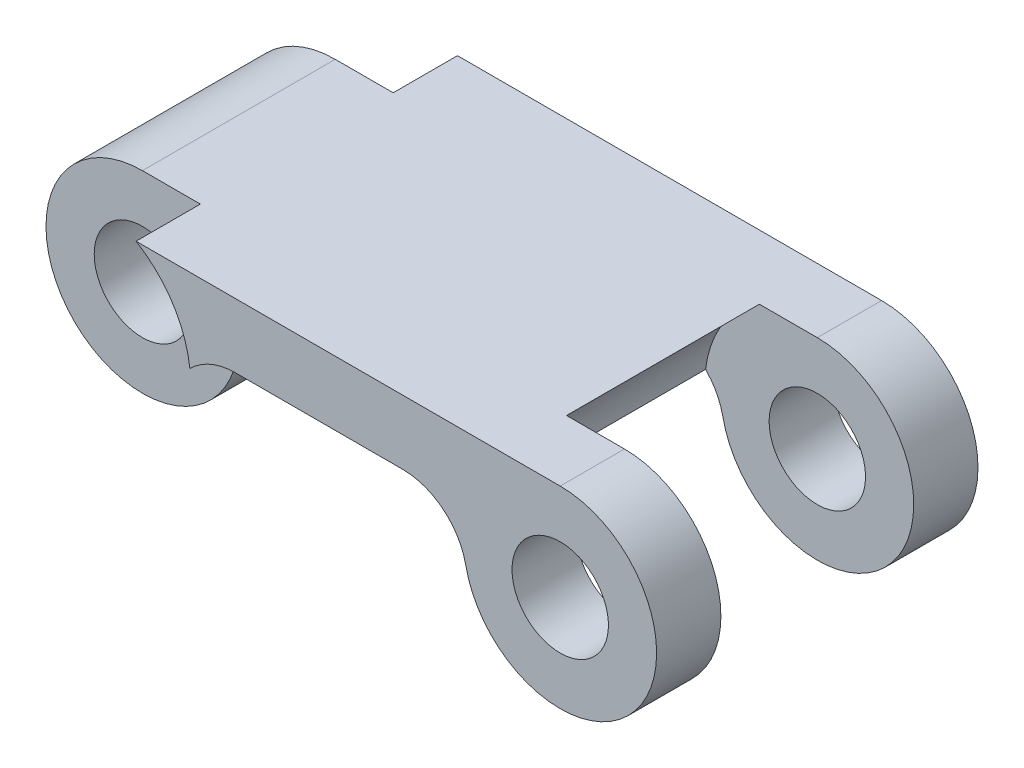
ISO-10303-21;
HEADER;
FILE_DESCRIPTION(('STEP AP214'),'2;1');
FILE_NAME('part.step','',(''),(''),'','','');
FILE_SCHEMA(('AUTOMOTIVE_DESIGN { 1 0 10303 214 1 1 1 1 }'));
ENDSEC;
DATA;
#1=APPLICATION_CONTEXT('core data for automotive mechanical design processes');
#2=APPLICATION_PROTOCOL_DEFINITION('international standard','automotive_design',2000,#1);
#3=PRODUCT_CONTEXT('',#1,'mechanical');
#4=PRODUCT('Part','Part','',(#3));
#5=PRODUCT_RELATED_PRODUCT_CATEGORY('part','',(#4));
#6=PRODUCT_DEFINITION_FORMATION('','',#4);
#7=PRODUCT_DEFINITION_CONTEXT('part definition',#1,'design');
#8=PRODUCT_DEFINITION('design','',#6,#7);
#9=PRODUCT_DEFINITION_SHAPE('','',#8);
#10=(LENGTH_UNIT() NAMED_UNIT(*) SI_UNIT(.MILLI.,.METRE.));
#11=(NAMED_UNIT(*) PLANE_ANGLE_UNIT() SI_UNIT($,.RADIAN.));
#12=(NAMED_UNIT(*) SI_UNIT($,.STERADIAN.) SOLID_ANGLE_UNIT());
#13=UNCERTAINTY_MEASURE_WITH_UNIT(LENGTH_MEASURE(1.E-05),#10,'distance_accuracy_value','');
#14=(GEOMETRIC_REPRESENTATION_CONTEXT(3) GLOBAL_UNCERTAINTY_ASSIGNED_CONTEXT((#13)) GLOBAL_UNIT_ASSIGNED_CONTEXT((#10,
#11,#12)) REPRESENTATION_CONTEXT('',''));
#15=CARTESIAN_POINT('',(0.,0.,0.));
#16=DIRECTION('',(0.,0.,1.));
#17=DIRECTION('',(1.,0.,0.));
#18=AXIS2_PLACEMENT_3D('',#15,#16,#17);
#19=CARTESIAN_POINT('',(-21.9965399719067,9.31366870482719,10.));
#20=DIRECTION('',(0.,1.,0.));
#21=DIRECTION('',(0.,0.,1.));
#22=AXIS2_PLACEMENT_3D('',#19,#20,#21);
#23=PLANE('',#22);
#24=DIRECTION('',(1.,0.,0.));
#25=VECTOR('',#24,1.);
#26=CARTESIAN_POINT('',(-21.9965399719067,9.31366870482719,0.));
#27=LINE('',#26,#25);
#28=CARTESIAN_POINT('',(-19.9259876110865,9.31366870482719,0.));
#29=VERTEX_POINT('',#28);
#30=CARTESIAN_POINT('',(-14.7239465822193,9.31366870482719,0.));
#31=VERTEX_POINT('',#30);
#32=EDGE_CURVE('E237',#29,#31,#27,.T.);
#33=ORIENTED_EDGE('',*,*,#32,.T.);
#34=DIRECTION('',(0.,0.,1.));
#35=VECTOR('',#34,1.);
#36=CARTESIAN_POINT('',(-14.7239465822193,9.31366870482719,2.));
#37=LINE('',#36,#35);
#38=CARTESIAN_POINT('',(-14.7239465822193,9.31366870482719,10.));
#39=VERTEX_POINT('',#38);
#40=EDGE_CURVE('E183',#31,#39,#37,.T.);
#41=ORIENTED_EDGE('',*,*,#40,.T.);
#42=DIRECTION('',(1.,0.,0.));
#43=VECTOR('',#42,1.);
#44=CARTESIAN_POINT('',(-21.9965399719067,9.31366870482719,10.));
#45=LINE('',#44,#43);
#46=CARTESIAN_POINT('',(-19.9259876110865,9.31366870482719,10.));
#47=VERTEX_POINT('',#46);
#48=EDGE_CURVE('E240',#47,#39,#45,.T.);
#49=ORIENTED_EDGE('',*,*,#48,.F.);
#50=DIRECTION('',(0.,0.,1.));
#51=VECTOR('',#50,1.);
#52=CARTESIAN_POINT('',(-19.9259876110865,9.31366870482719,2.));
#53=LINE('',#52,#51);
#54=EDGE_CURVE('E150',#47,#29,#53,.F.);
#55=ORIENTED_EDGE('',*,*,#54,.T.);
#56=EDGE_LOOP('',(#33,#41,#49,#55));
#57=FACE_BOUND('',#56,.T.);
#58=ADVANCED_FACE('F33',(#57),#23,.F.);
#59=CARTESIAN_POINT('',(-9.82496709665291,8.3136687048272,10.));
#60=DIRECTION('',(0.,0.,-1.));
#61=DIRECTION('',(-1.,0.,0.));
#62=AXIS2_PLACEMENT_3D('',#59,#60,#61);
#63=CYLINDRICAL_SURFACE('',#62,3.);
#64=CARTESIAN_POINT('',(-9.82496709665291,8.3136687048272,10.));
#65=DIRECTION('',(0.,0.,1.));
#66=DIRECTION('',(-1.,0.,0.));
#67=AXIS2_PLACEMENT_3D('',#64,#65,#66);
#68=CIRCLE('',#67,3.);
#69=CARTESIAN_POINT('',(-12.7643547879927,7.7136687048272,10.));
#70=VERTEX_POINT('',#69);
#71=CARTESIAN_POINT('',(-9.82496709665291,11.3136687048272,10.));
#72=VERTEX_POINT('',#71);
#73=EDGE_CURVE('E243',#70,#72,#68,.T.);
#74=ORIENTED_EDGE('',*,*,#73,.F.);
#75=DIRECTION('',(0.,0.,-1.));
#76=VECTOR('',#75,1.);
#77=CARTESIAN_POINT('',(-12.7643547879927,7.7136687048272,9.));
#78=LINE('',#77,#76);
#79=CARTESIAN_POINT('',(-12.7643547879927,7.7136687048272,8.));
#80=VERTEX_POINT('',#79);
#81=EDGE_CURVE('E185',#70,#80,#78,.T.);
#82=ORIENTED_EDGE('',*,*,#81,.T.);
#83=CARTESIAN_POINT('',(-9.82496709665291,8.3136687048272,8.));
#84=DIRECTION('',(0.,0.,-1.));
#85=DIRECTION('',(-1.,0.,0.));
#86=AXIS2_PLACEMENT_3D('',#83,#84,#85);
#87=CIRCLE('',#86,3.);
#88=CARTESIAN_POINT('',(-9.82496709665291,11.3136687048272,8.));
#89=VERTEX_POINT('',#88);
#90=EDGE_CURVE('E197',#89,#80,#87,.T.);
#91=ORIENTED_EDGE('',*,*,#90,.F.);
#92=DIRECTION('',(0.,0.,-1.));
#93=VECTOR('',#92,1.);
#94=CARTESIAN_POINT('',(-9.82496709665291,11.3136687048272,10.));
#95=LINE('',#94,#93);
#96=EDGE_CURVE('E258',#72,#89,#95,.T.);
#97=ORIENTED_EDGE('',*,*,#96,.F.);
#98=EDGE_LOOP('',(#74,#82,#91,#97));
#99=FACE_BOUND('',#98,.T.);
#100=ADVANCED_FACE('F281',(#99),#63,.T.);
#101=CARTESIAN_POINT('',(-24.8249670966529,11.3136687048272,10.));
#102=DIRECTION('',(0.,-1.,0.));
#103=DIRECTION('',(0.,0.,-1.));
#104=AXIS2_PLACEMENT_3D('',#101,#102,#103);
#105=PLANE('',#104);
#106=DIRECTION('',(1.,0.,0.));
#107=VECTOR('',#106,1.);
#108=CARTESIAN_POINT('',(-24.8249670966529,11.3136687048272,8.));
#109=LINE('',#108,#107);
#110=CARTESIAN_POINT('',(-11.6277427343849,11.3136687048272,8.));
#111=VERTEX_POINT('',#110);
#112=EDGE_CURVE('E149',#111,#89,#109,.T.);
#113=ORIENTED_EDGE('',*,*,#112,.F.);
#114=DIRECTION('',(0.,0.,-1.));
#115=VECTOR('',#114,1.);
#116=CARTESIAN_POINT('',(-11.6277427343849,11.3136687048272,8.));
#117=LINE('',#116,#115);
#118=CARTESIAN_POINT('',(-11.6277427343849,11.3136687048272,2.));
#119=VERTEX_POINT('',#118);
#120=EDGE_CURVE('E142',#111,#119,#117,.T.);
#121=ORIENTED_EDGE('',*,*,#120,.T.);
#122=DIRECTION('',(1.,0.,0.));
#123=VECTOR('',#122,1.);
#124=CARTESIAN_POINT('',(-24.8249670966529,11.3136687048272,2.));
#125=LINE('',#124,#123);
#126=CARTESIAN_POINT('',(-9.82496709665291,11.3136687048272,2.));
#127=VERTEX_POINT('',#126);
#128=EDGE_CURVE('E131',#119,#127,#125,.T.);
#129=ORIENTED_EDGE('',*,*,#128,.T.);
#130=CARTESIAN_POINT('',(-9.82496709665291,11.3136687048272,0.));
#131=VERTEX_POINT('',#130);
#132=EDGE_CURVE('E205',#127,#131,#95,.T.);
#133=ORIENTED_EDGE('',*,*,#132,.T.);
#134=DIRECTION('',(-1.,0.,0.));
#135=VECTOR('',#134,1.);
#136=CARTESIAN_POINT('',(-24.8249670966529,11.3136687048272,0.));
#137=LINE('',#136,#135);
#138=CARTESIAN_POINT('',(-23.0221914589209,11.3136687048272,0.));
#139=VERTEX_POINT('',#138);
#140=EDGE_CURVE('E244',#131,#139,#137,.T.);
#141=ORIENTED_EDGE('',*,*,#140,.T.);
#142=DIRECTION('',(0.,0.,-1.));
#143=VECTOR('',#142,1.);
#144=CARTESIAN_POINT('',(-23.0221914589209,11.3136687048272,2.));
#145=LINE('',#144,#143);
#146=CARTESIAN_POINT('',(-23.0221914589209,11.3136687048272,2.));
#147=VERTEX_POINT('',#146);
#148=EDGE_CURVE('E230',#139,#147,#145,.F.);
#149=ORIENTED_EDGE('',*,*,#148,.T.);
#150=DIRECTION('',(1.,0.,0.));
#151=VECTOR('',#150,1.);
#152=CARTESIAN_POINT('',(-24.8249670966529,11.3136687048272,2.));
#153=LINE('',#152,#151);
#154=CARTESIAN_POINT('',(-24.8249670966529,11.3136687048272,2.));
#155=VERTEX_POINT('',#154);
#156=EDGE_CURVE('E226',#155,#147,#153,.T.);
#157=ORIENTED_EDGE('',*,*,#156,.F.);
#158=DIRECTION('',(0.,0.,-1.));
#159=VECTOR('',#158,1.);
#160=CARTESIAN_POINT('',(-24.8249670966529,11.3136687048272,10.));
#161=LINE('',#160,#159);
#162=CARTESIAN_POINT('',(-24.8249670966529,11.3136687048272,8.));
#163=VERTEX_POINT('',#162);
#164=EDGE_CURVE('E249',#163,#155,#161,.T.);
#165=ORIENTED_EDGE('',*,*,#164,.F.);
#166=DIRECTION('',(1.,0.,0.));
#167=VECTOR('',#166,1.);
#168=CARTESIAN_POINT('',(-24.8249670966529,11.3136687048272,8.));
#169=LINE('',#168,#167);
#170=CARTESIAN_POINT('',(-23.0221914589209,11.3136687048272,8.));
#171=VERTEX_POINT('',#170);
#172=EDGE_CURVE('E151',#163,#171,#169,.T.);
#173=ORIENTED_EDGE('',*,*,#172,.T.);
#174=DIRECTION('',(0.,0.,-1.));
#175=VECTOR('',#174,1.);
#176=CARTESIAN_POINT('',(-23.0221914589209,11.3136687048272,20.));
#177=LINE('',#176,#175);
#178=CARTESIAN_POINT('',(-23.0221914589209,11.3136687048272,10.));
#179=VERTEX_POINT('',#178);
#180=EDGE_CURVE('E213',#171,#179,#177,.F.);
#181=ORIENTED_EDGE('',*,*,#180,.T.);
#182=DIRECTION('',(-1.,0.,0.));
#183=VECTOR('',#182,1.);
#184=CARTESIAN_POINT('',(-24.8249670966529,11.3136687048272,10.));
#185=LINE('',#184,#183);
#186=EDGE_CURVE('E246',#72,#179,#185,.T.);
#187=ORIENTED_EDGE('',*,*,#186,.F.);
#188=ORIENTED_EDGE('',*,*,#96,.T.);
#189=EDGE_LOOP('',(#113,#121,#129,#133,#141,#149,#157,#165,#173,#181,#187,#188));
#190=FACE_BOUND('',#189,.T.);
#191=ADVANCED_FACE('F147',(#190),#105,.F.);
#192=CARTESIAN_POINT('',(-9.82496709665291,8.3136687048272,10.));
#193=DIRECTION('',(0.,0.,-1.));
#194=DIRECTION('',(-1.,0.,0.));
#195=AXIS2_PLACEMENT_3D('',#192,#193,#194);
#196=CYLINDRICAL_SURFACE('',#195,1.5);
#197=CARTESIAN_POINT('',(-9.82496709665291,8.3136687048272,10.));
#198=DIRECTION('',(0.,0.,-1.));
#199=DIRECTION('',(-1.,0.,0.));
#200=AXIS2_PLACEMENT_3D('',#197,#198,#199);
#201=CIRCLE('',#200,1.5);
#202=CARTESIAN_POINT('',(-11.3249670966529,8.3136687048272,10.));
#203=VERTEX_POINT('',#202);
#204=EDGE_CURVE('E234',#203,#203,#201,.T.);
#205=ORIENTED_EDGE('',*,*,#204,.F.);
#206=EDGE_LOOP('',(#205));
#207=FACE_BOUND('',#206,.T.);
#208=CARTESIAN_POINT('',(-9.82496709665291,8.3136687048272,8.));
#209=DIRECTION('',(0.,0.,-1.));
#210=DIRECTION('',(-1.,0.,0.));
#211=AXIS2_PLACEMENT_3D('',#208,#209,#210);
#212=CIRCLE('',#211,1.5);
#213=CARTESIAN_POINT('',(-11.3249670966529,8.3136687048272,8.));
#214=VERTEX_POINT('',#213);
#215=EDGE_CURVE('E160',#214,#214,#212,.F.);
#216=ORIENTED_EDGE('',*,*,#215,.F.);
#217=EDGE_LOOP('',(#216));
#218=FACE_BOUND('',#217,.T.);
#219=ADVANCED_FACE('F294',(#207,#218),#196,.F.);
#220=CARTESIAN_POINT('',(-24.8249670966529,8.3136687048272,10.));
#221=DIRECTION('',(0.,0.,-1.));
#222=DIRECTION('',(-1.,0.,0.));
#223=AXIS2_PLACEMENT_3D('',#220,#221,#222);
#224=CYLINDRICAL_SURFACE('',#223,3.);
#225=CARTESIAN_POINT('',(-24.8249670966529,8.3136687048272,2.));
#226=DIRECTION('',(0.,0.,-1.));
#227=DIRECTION('',(-1.,0.,0.));
#228=AXIS2_PLACEMENT_3D('',#225,#226,#227);
#229=CIRCLE('',#228,3.);
#230=CARTESIAN_POINT('',(-21.8855794053131,7.7136687048272,2.));
#231=VERTEX_POINT('',#230);
#232=EDGE_CURVE('E228',#231,#155,#229,.T.);
#233=ORIENTED_EDGE('',*,*,#232,.F.);
#234=DIRECTION('',(0.,0.,-1.));
#235=VECTOR('',#234,1.);
#236=CARTESIAN_POINT('',(-21.8855794053131,7.7136687048272,10.));
#237=LINE('',#236,#235);
#238=CARTESIAN_POINT('',(-21.8855794053131,7.7136687048272,8.));
#239=VERTEX_POINT('',#238);
#240=EDGE_CURVE('E154',#231,#239,#237,.F.);
#241=ORIENTED_EDGE('',*,*,#240,.T.);
#242=CARTESIAN_POINT('',(-24.8249670966529,8.3136687048272,8.));
#243=DIRECTION('',(0.,0.,-1.));
#244=DIRECTION('',(-1.,0.,0.));
#245=AXIS2_PLACEMENT_3D('',#242,#243,#244);
#246=CIRCLE('',#245,3.);
#247=EDGE_CURVE('E216',#239,#163,#246,.T.);
#248=ORIENTED_EDGE('',*,*,#247,.T.);
#249=ORIENTED_EDGE('',*,*,#164,.T.);
#250=EDGE_LOOP('',(#233,#241,#248,#249));
#251=FACE_BOUND('',#250,.T.);
#252=ADVANCED_FACE('F291',(#251),#224,.T.);
#253=CARTESIAN_POINT('',(-24.8249670966529,8.3136687048272,10.));
#254=DIRECTION('',(0.,0.,-1.));
#255=DIRECTION('',(-1.,0.,0.));
#256=AXIS2_PLACEMENT_3D('',#253,#254,#255);
#257=CYLINDRICAL_SURFACE('',#256,1.5);
#258=CARTESIAN_POINT('',(-24.8249670966529,8.3136687048272,8.));
#259=DIRECTION('',(0.,0.,-1.));
#260=DIRECTION('',(-1.,0.,0.));
#261=AXIS2_PLACEMENT_3D('',#258,#259,#260);
#262=CIRCLE('',#261,1.5);
#263=CARTESIAN_POINT('',(-26.3249670966529,8.3136687048272,8.));
#264=VERTEX_POINT('',#263);
#265=EDGE_CURVE('E218',#264,#264,#262,.F.);
#266=ORIENTED_EDGE('',*,*,#265,.T.);
#267=EDGE_LOOP('',(#266));
#268=FACE_BOUND('',#267,.T.);
#269=CARTESIAN_POINT('',(-24.8249670966529,8.3136687048272,2.));
#270=DIRECTION('',(0.,0.,-1.));
#271=DIRECTION('',(-1.,0.,0.));
#272=AXIS2_PLACEMENT_3D('',#269,#270,#271);
#273=CIRCLE('',#272,1.5);
#274=CARTESIAN_POINT('',(-26.3249670966529,8.3136687048272,2.));
#275=VERTEX_POINT('',#274);
#276=EDGE_CURVE('E224',#275,#275,#273,.F.);
#277=ORIENTED_EDGE('',*,*,#276,.F.);
#278=EDGE_LOOP('',(#277));
#279=FACE_BOUND('',#278,.T.);
#280=ADVANCED_FACE('F293',(#268,#279),#257,.F.);
#281=CARTESIAN_POINT('',(-9.82496709665291,8.3136687048272,2.));
#282=DIRECTION('',(0.,0.,-1.));
#283=DIRECTION('',(-1.,0.,0.));
#284=AXIS2_PLACEMENT_3D('',#281,#282,#283);
#285=CIRCLE('',#284,3.);
#286=CARTESIAN_POINT('',(-12.7643547879927,7.7136687048272,2.));
#287=VERTEX_POINT('',#286);
#288=EDGE_CURVE('E134',#127,#287,#285,.T.);
#289=ORIENTED_EDGE('',*,*,#288,.T.);
#290=DIRECTION('',(0.,0.,-1.));
#291=VECTOR('',#290,1.);
#292=CARTESIAN_POINT('',(-12.7643547879927,7.7136687048272,10.));
#293=LINE('',#292,#291);
#294=CARTESIAN_POINT('',(-12.7643547879927,7.7136687048272,0.));
#295=VERTEX_POINT('',#294);
#296=EDGE_CURVE('E180',#287,#295,#293,.T.);
#297=ORIENTED_EDGE('',*,*,#296,.T.);
#298=CARTESIAN_POINT('',(-9.82496709665291,8.3136687048272,0.));
#299=DIRECTION('',(0.,0.,1.));
#300=DIRECTION('',(-1.,0.,0.));
#301=AXIS2_PLACEMENT_3D('',#298,#299,#300);
#302=CIRCLE('',#301,3.);
#303=EDGE_CURVE('E252',#295,#131,#302,.T.);
#304=ORIENTED_EDGE('',*,*,#303,.T.);
#305=ORIENTED_EDGE('',*,*,#132,.F.);
#306=EDGE_LOOP('',(#289,#297,#304,#305));
#307=FACE_BOUND('',#306,.T.);
#308=ADVANCED_FACE('F203',(#307),#63,.T.);
#309=CARTESIAN_POINT('',(-24.8249670966529,8.3136687048272,10.));
#310=DIRECTION('',(0.,0.,1.));
#311=DIRECTION('',(1.,0.,0.));
#312=AXIS2_PLACEMENT_3D('',#309,#310,#311);
#313=PLANE('',#312);
#314=CARTESIAN_POINT('',(-24.8249670966529,8.3136687048272,10.));
#315=DIRECTION('',(0.,0.,1.));
#316=DIRECTION('',(1.,0.,0.));
#317=AXIS2_PLACEMENT_3D('',#314,#315,#316);
#318=CIRCLE('',#317,3.5);
#319=CARTESIAN_POINT('',(-21.3485708088073,8.71946280268168,10.));
#320=VERTEX_POINT('',#319);
#321=EDGE_CURVE('E157',#320,#179,#318,.T.);
#322=ORIENTED_EDGE('',*,*,#321,.F.);
#323=CARTESIAN_POINT('',(-19.9259876110865,7.31366870482719,10.));
#324=DIRECTION('',(0.,0.,1.));
#325=DIRECTION('',(1.,0.,0.));
#326=AXIS2_PLACEMENT_3D('',#323,#324,#325);
#327=CIRCLE('',#326,2.);
#328=EDGE_CURVE('E178',#320,#47,#327,.F.);
#329=ORIENTED_EDGE('',*,*,#328,.T.);
#330=ORIENTED_EDGE('',*,*,#48,.T.);
#331=CARTESIAN_POINT('',(-14.7239465822193,7.31366870482719,10.));
#332=DIRECTION('',(0.,0.,1.));
#333=DIRECTION('',(1.,0.,0.));
#334=AXIS2_PLACEMENT_3D('',#331,#332,#333);
#335=CIRCLE('',#334,2.);
#336=EDGE_CURVE('E189',#39,#70,#335,.F.);
#337=ORIENTED_EDGE('',*,*,#336,.T.);
#338=ORIENTED_EDGE('',*,*,#73,.T.);
#339=ORIENTED_EDGE('',*,*,#186,.T.);
#340=EDGE_LOOP('',(#322,#329,#330,#337,#338,#339));
#341=FACE_BOUND('',#340,.T.);
#342=ORIENTED_EDGE('',*,*,#204,.T.);
#343=EDGE_LOOP('',(#342));
#344=FACE_BOUND('',#343,.T.);
#345=ADVANCED_FACE('F333',(#341,#344),#313,.T.);
#346=CARTESIAN_POINT('',(-24.8249670966529,8.3136687048272,0.));
#347=DIRECTION('',(0.,0.,1.));
#348=DIRECTION('',(1.,0.,0.));
#349=AXIS2_PLACEMENT_3D('',#346,#347,#348);
#350=PLANE('',#349);
#351=CARTESIAN_POINT('',(-9.82496709665291,8.3136687048272,0.));
#352=DIRECTION('',(0.,0.,-1.));
#353=DIRECTION('',(-1.,0.,0.));
#354=AXIS2_PLACEMENT_3D('',#351,#352,#353);
#355=CIRCLE('',#354,1.5);
#356=CARTESIAN_POINT('',(-11.3249670966529,8.3136687048272,0.));
#357=VERTEX_POINT('',#356);
#358=EDGE_CURVE('E233',#357,#357,#355,.T.);
#359=ORIENTED_EDGE('',*,*,#358,.F.);
#360=EDGE_LOOP('',(#359));
#361=FACE_BOUND('',#360,.T.);
#362=ORIENTED_EDGE('',*,*,#32,.F.);
#363=CARTESIAN_POINT('',(-19.9259876110865,7.31366870482719,0.));
#364=DIRECTION('',(0.,0.,1.));
#365=DIRECTION('',(1.,0.,0.));
#366=AXIS2_PLACEMENT_3D('',#363,#364,#365);
#367=CIRCLE('',#366,2.);
#368=CARTESIAN_POINT('',(-21.3485708088073,8.71946280268168,0.));
#369=VERTEX_POINT('',#368);
#370=EDGE_CURVE('E164',#29,#369,#367,.T.);
#371=ORIENTED_EDGE('',*,*,#370,.T.);
#372=CARTESIAN_POINT('',(-24.8249670966529,8.3136687048272,0.));
#373=DIRECTION('',(0.,0.,-1.));
#374=DIRECTION('',(-1.,0.,0.));
#375=AXIS2_PLACEMENT_3D('',#372,#373,#374);
#376=CIRCLE('',#375,3.5);
#377=EDGE_CURVE('E221',#139,#369,#376,.T.);
#378=ORIENTED_EDGE('',*,*,#377,.F.);
#379=ORIENTED_EDGE('',*,*,#140,.F.);
#380=ORIENTED_EDGE('',*,*,#303,.F.);
#381=CARTESIAN_POINT('',(-14.7239465822193,7.31366870482719,0.));
#382=DIRECTION('',(0.,0.,1.));
#383=DIRECTION('',(1.,0.,0.));
#384=AXIS2_PLACEMENT_3D('',#381,#382,#383);
#385=CIRCLE('',#384,2.);
#386=EDGE_CURVE('E187',#295,#31,#385,.T.);
#387=ORIENTED_EDGE('',*,*,#386,.T.);
#388=EDGE_LOOP('',(#362,#371,#378,#379,#380,#387));
#389=FACE_BOUND('',#388,.T.);
#390=ADVANCED_FACE('F330',(#361,#389),#350,.F.);
#391=CARTESIAN_POINT('',(-9.82496709665291,8.3136687048272,2.));
#392=DIRECTION('',(0.,0.,-1.));
#393=DIRECTION('',(-1.,0.,0.));
#394=AXIS2_PLACEMENT_3D('',#391,#392,#393);
#395=CIRCLE('',#394,1.5);
#396=CARTESIAN_POINT('',(-11.3249670966529,8.3136687048272,2.));
#397=VERTEX_POINT('',#396);
#398=EDGE_CURVE('E139',#397,#397,#395,.F.);
#399=ORIENTED_EDGE('',*,*,#398,.T.);
#400=EDGE_LOOP('',(#399));
#401=FACE_BOUND('',#400,.T.);
#402=ORIENTED_EDGE('',*,*,#358,.T.);
#403=EDGE_LOOP('',(#402));
#404=FACE_BOUND('',#403,.T.);
#405=ADVANCED_FACE('F266',(#401,#404),#196,.F.);
#406=CARTESIAN_POINT('',(-24.8249670966529,8.3136687048272,2.));
#407=DIRECTION('',(0.,0.,-1.));
#408=DIRECTION('',(-1.,0.,0.));
#409=AXIS2_PLACEMENT_3D('',#406,#407,#408);
#410=CYLINDRICAL_SURFACE('',#409,3.5);
#411=CARTESIAN_POINT('',(-24.8249670966529,8.3136687048272,2.));
#412=DIRECTION('',(0.,0.,-1.));
#413=DIRECTION('',(-1.,0.,0.));
#414=AXIS2_PLACEMENT_3D('',#411,#412,#413);
#415=CIRCLE('',#414,3.5);
#416=CARTESIAN_POINT('',(-21.3485708088073,8.71946280268168,2.));
#417=VERTEX_POINT('',#416);
#418=EDGE_CURVE('E222',#147,#417,#415,.T.);
#419=ORIENTED_EDGE('',*,*,#418,.F.);
#420=ORIENTED_EDGE('',*,*,#148,.F.);
#421=ORIENTED_EDGE('',*,*,#377,.T.);
#422=DIRECTION('',(0.,0.,-1.));
#423=VECTOR('',#422,1.);
#424=CARTESIAN_POINT('',(-21.3485708088073,8.71946280268168,0.));
#425=LINE('',#424,#423);
#426=EDGE_CURVE('E167',#369,#417,#425,.F.);
#427=ORIENTED_EDGE('',*,*,#426,.T.);
#428=EDGE_LOOP('',(#419,#420,#421,#427));
#429=FACE_BOUND('',#428,.T.);
#430=ADVANCED_FACE('F323',(#429),#410,.F.);
#431=CARTESIAN_POINT('',(-24.8249670966529,8.3136687048272,2.));
#432=DIRECTION('',(0.,0.,-1.));
#433=DIRECTION('',(-1.,0.,0.));
#434=AXIS2_PLACEMENT_3D('',#431,#432,#433);
#435=PLANE('',#434);
#436=ORIENTED_EDGE('',*,*,#276,.T.);
#437=EDGE_LOOP('',(#436));
#438=FACE_BOUND('',#437,.T.);
#439=ORIENTED_EDGE('',*,*,#418,.T.);
#440=CARTESIAN_POINT('',(-19.9259876110865,7.31366870482719,2.));
#441=DIRECTION('',(0.,0.,-1.));
#442=DIRECTION('',(-1.,0.,0.));
#443=AXIS2_PLACEMENT_3D('',#440,#441,#442);
#444=CIRCLE('',#443,2.);
#445=EDGE_CURVE('E170',#417,#231,#444,.F.);
#446=ORIENTED_EDGE('',*,*,#445,.T.);
#447=ORIENTED_EDGE('',*,*,#232,.T.);
#448=ORIENTED_EDGE('',*,*,#156,.T.);
#449=EDGE_LOOP('',(#439,#446,#447,#448));
#450=FACE_BOUND('',#449,.T.);
#451=ADVANCED_FACE('F321',(#438,#450),#435,.T.);
#452=CARTESIAN_POINT('',(-24.8249670966529,8.3136687048272,8.));
#453=DIRECTION('',(0.,0.,-1.));
#454=DIRECTION('',(-1.,0.,0.));
#455=AXIS2_PLACEMENT_3D('',#452,#453,#454);
#456=PLANE('',#455);
#457=CARTESIAN_POINT('',(-24.8249670966529,8.3136687048272,8.));
#458=DIRECTION('',(0.,0.,-1.));
#459=DIRECTION('',(-1.,0.,0.));
#460=AXIS2_PLACEMENT_3D('',#457,#458,#459);
#461=CIRCLE('',#460,3.5);
#462=CARTESIAN_POINT('',(-21.3485708088073,8.71946280268168,8.));
#463=VERTEX_POINT('',#462);
#464=EDGE_CURVE('E211',#171,#463,#461,.T.);
#465=ORIENTED_EDGE('',*,*,#464,.F.);
#466=ORIENTED_EDGE('',*,*,#172,.F.);
#467=ORIENTED_EDGE('',*,*,#247,.F.);
#468=CARTESIAN_POINT('',(-19.9259876110865,7.31366870482719,8.));
#469=DIRECTION('',(0.,0.,-1.));
#470=DIRECTION('',(-1.,0.,0.));
#471=AXIS2_PLACEMENT_3D('',#468,#469,#470);
#472=CIRCLE('',#471,2.);
#473=EDGE_CURVE('E172',#239,#463,#472,.T.);
#474=ORIENTED_EDGE('',*,*,#473,.T.);
#475=EDGE_LOOP('',(#465,#466,#467,#474));
#476=FACE_BOUND('',#475,.T.);
#477=ORIENTED_EDGE('',*,*,#265,.F.);
#478=EDGE_LOOP('',(#477));
#479=FACE_BOUND('',#478,.T.);
#480=ADVANCED_FACE('F317',(#476,#479),#456,.F.);
#481=CARTESIAN_POINT('',(-24.8249670966529,8.3136687048272,20.));
#482=DIRECTION('',(0.,0.,-1.));
#483=DIRECTION('',(-1.,0.,0.));
#484=AXIS2_PLACEMENT_3D('',#481,#482,#483);
#485=CYLINDRICAL_SURFACE('',#484,3.5);
#486=ORIENTED_EDGE('',*,*,#321,.T.);
#487=ORIENTED_EDGE('',*,*,#180,.F.);
#488=ORIENTED_EDGE('',*,*,#464,.T.);
#489=DIRECTION('',(0.,0.,-1.));
#490=VECTOR('',#489,1.);
#491=CARTESIAN_POINT('',(-21.3485708088073,8.71946280268168,8.));
#492=LINE('',#491,#490);
#493=EDGE_CURVE('E175',#463,#320,#492,.F.);
#494=ORIENTED_EDGE('',*,*,#493,.T.);
#495=EDGE_LOOP('',(#486,#487,#488,#494));
#496=FACE_BOUND('',#495,.T.);
#497=ADVANCED_FACE('F338',(#496),#485,.F.);
#498=CARTESIAN_POINT('',(-9.82496709665291,8.3136687048272,8.));
#499=DIRECTION('',(0.,0.,-1.));
#500=DIRECTION('',(-1.,0.,0.));
#501=AXIS2_PLACEMENT_3D('',#498,#499,#500);
#502=CYLINDRICAL_SURFACE('',#501,3.5);
#503=CARTESIAN_POINT('',(-9.82496709665291,8.3136687048272,2.));
#504=DIRECTION('',(0.,0.,-1.));
#505=DIRECTION('',(-1.,0.,0.));
#506=AXIS2_PLACEMENT_3D('',#503,#504,#505);
#507=CIRCLE('',#506,3.5);
#508=CARTESIAN_POINT('',(-13.3013633844985,8.71946280268168,2.));
#509=VERTEX_POINT('',#508);
#510=EDGE_CURVE('E47',#509,#119,#507,.T.);
#511=ORIENTED_EDGE('',*,*,#510,.T.);
#512=ORIENTED_EDGE('',*,*,#120,.F.);
#513=CARTESIAN_POINT('',(-9.82496709665291,8.3136687048272,8.));
#514=DIRECTION('',(0.,0.,-1.));
#515=DIRECTION('',(-1.,0.,0.));
#516=AXIS2_PLACEMENT_3D('',#513,#514,#515);
#517=CIRCLE('',#516,3.5);
#518=CARTESIAN_POINT('',(-13.3013633844985,8.71946280268168,8.));
#519=VERTEX_POINT('',#518);
#520=EDGE_CURVE('E54',#519,#111,#517,.T.);
#521=ORIENTED_EDGE('',*,*,#520,.F.);
#522=DIRECTION('',(0.,0.,-1.));
#523=VECTOR('',#522,1.);
#524=CARTESIAN_POINT('',(-13.3013633844985,8.71946280268168,8.));
#525=LINE('',#524,#523);
#526=EDGE_CURVE('E41',#519,#509,#525,.T.);
#527=ORIENTED_EDGE('',*,*,#526,.T.);
#528=EDGE_LOOP('',(#511,#512,#521,#527));
#529=FACE_BOUND('',#528,.T.);
#530=ADVANCED_FACE('F141',(#529),#502,.F.);
#531=CARTESIAN_POINT('',(-9.82496709665291,8.3136687048272,8.));
#532=DIRECTION('',(0.,0.,-1.));
#533=DIRECTION('',(-1.,0.,0.));
#534=AXIS2_PLACEMENT_3D('',#531,#532,#533);
#535=PLANE('',#534);
#536=ORIENTED_EDGE('',*,*,#215,.T.);
#537=EDGE_LOOP('',(#536));
#538=FACE_BOUND('',#537,.T.);
#539=ORIENTED_EDGE('',*,*,#90,.T.);
#540=CARTESIAN_POINT('',(-14.7239465822193,7.31366870482719,8.));
#541=DIRECTION('',(0.,0.,-1.));
#542=DIRECTION('',(-1.,0.,0.));
#543=AXIS2_PLACEMENT_3D('',#540,#541,#542);
#544=CIRCLE('',#543,2.);
#545=EDGE_CURVE('E191',#80,#519,#544,.F.);
#546=ORIENTED_EDGE('',*,*,#545,.T.);
#547=ORIENTED_EDGE('',*,*,#520,.T.);
#548=ORIENTED_EDGE('',*,*,#112,.T.);
#549=EDGE_LOOP('',(#539,#546,#547,#548));
#550=FACE_BOUND('',#549,.T.);
#551=ADVANCED_FACE('F195',(#538,#550),#535,.T.);
#552=CARTESIAN_POINT('',(-9.82496709665291,8.3136687048272,2.));
#553=DIRECTION('',(0.,0.,-1.));
#554=DIRECTION('',(-1.,0.,0.));
#555=AXIS2_PLACEMENT_3D('',#552,#553,#554);
#556=PLANE('',#555);
#557=ORIENTED_EDGE('',*,*,#398,.F.);
#558=EDGE_LOOP('',(#557));
#559=FACE_BOUND('',#558,.T.);
#560=ORIENTED_EDGE('',*,*,#288,.F.);
#561=ORIENTED_EDGE('',*,*,#128,.F.);
#562=ORIENTED_EDGE('',*,*,#510,.F.);
#563=CARTESIAN_POINT('',(-14.7239465822193,7.31366870482719,2.));
#564=DIRECTION('',(0.,0.,-1.));
#565=DIRECTION('',(-1.,0.,0.));
#566=AXIS2_PLACEMENT_3D('',#563,#564,#565);
#567=CIRCLE('',#566,2.);
#568=EDGE_CURVE('E11',#509,#287,#567,.T.);
#569=ORIENTED_EDGE('',*,*,#568,.T.);
#570=EDGE_LOOP('',(#560,#561,#562,#569));
#571=FACE_BOUND('',#570,.T.);
#572=ADVANCED_FACE('F132',(#559,#571),#556,.F.);
#573=CARTESIAN_POINT('',(-19.9259876110865,7.31366870482719,10.));
#574=DIRECTION('',(0.,0.,-1.));
#575=DIRECTION('',(-1.,0.,0.));
#576=AXIS2_PLACEMENT_3D('',#573,#574,#575);
#577=CYLINDRICAL_SURFACE('',#576,2.);
#578=ORIENTED_EDGE('',*,*,#473,.F.);
#579=ORIENTED_EDGE('',*,*,#240,.F.);
#580=ORIENTED_EDGE('',*,*,#445,.F.);
#581=ORIENTED_EDGE('',*,*,#426,.F.);
#582=ORIENTED_EDGE('',*,*,#370,.F.);
#583=ORIENTED_EDGE('',*,*,#54,.F.);
#584=ORIENTED_EDGE('',*,*,#328,.F.);
#585=ORIENTED_EDGE('',*,*,#493,.F.);
#586=EDGE_LOOP('',(#578,#579,#580,#581,#582,#583,#584,#585));
#587=FACE_BOUND('',#586,.T.);
#588=ADVANCED_FACE('F270',(#587),#577,.F.);
#589=CARTESIAN_POINT('',(-14.7239465822193,7.31366870482719,10.));
#590=DIRECTION('',(0.,0.,-1.));
#591=DIRECTION('',(-1.,0.,0.));
#592=AXIS2_PLACEMENT_3D('',#589,#590,#591);
#593=CYLINDRICAL_SURFACE('',#592,2.);
#594=ORIENTED_EDGE('',*,*,#336,.F.);
#595=ORIENTED_EDGE('',*,*,#40,.F.);
#596=ORIENTED_EDGE('',*,*,#386,.F.);
#597=ORIENTED_EDGE('',*,*,#296,.F.);
#598=ORIENTED_EDGE('',*,*,#568,.F.);
#599=ORIENTED_EDGE('',*,*,#526,.F.);
#600=ORIENTED_EDGE('',*,*,#545,.F.);
#601=ORIENTED_EDGE('',*,*,#81,.F.);
#602=EDGE_LOOP('',(#594,#595,#596,#597,#598,#599,#600,#601));
#603=FACE_BOUND('',#602,.T.);
#604=ADVANCED_FACE('F35',(#603),#593,.F.);
#605=CLOSED_SHELL('',(#58,#100,#191,#219,#252,#280,#308,#345,#390,#405,#430,#451,#480,#497,#530,
#551,#572,#588,#604));
#606=MANIFOLD_SOLID_BREP('B2',#605);
#607=ADVANCED_BREP_SHAPE_REPRESENTATION('',(#18,#606),#14);
#608=SHAPE_DEFINITION_REPRESENTATION(#9,#607);
ENDSEC;
END-ISO-10303-21;
